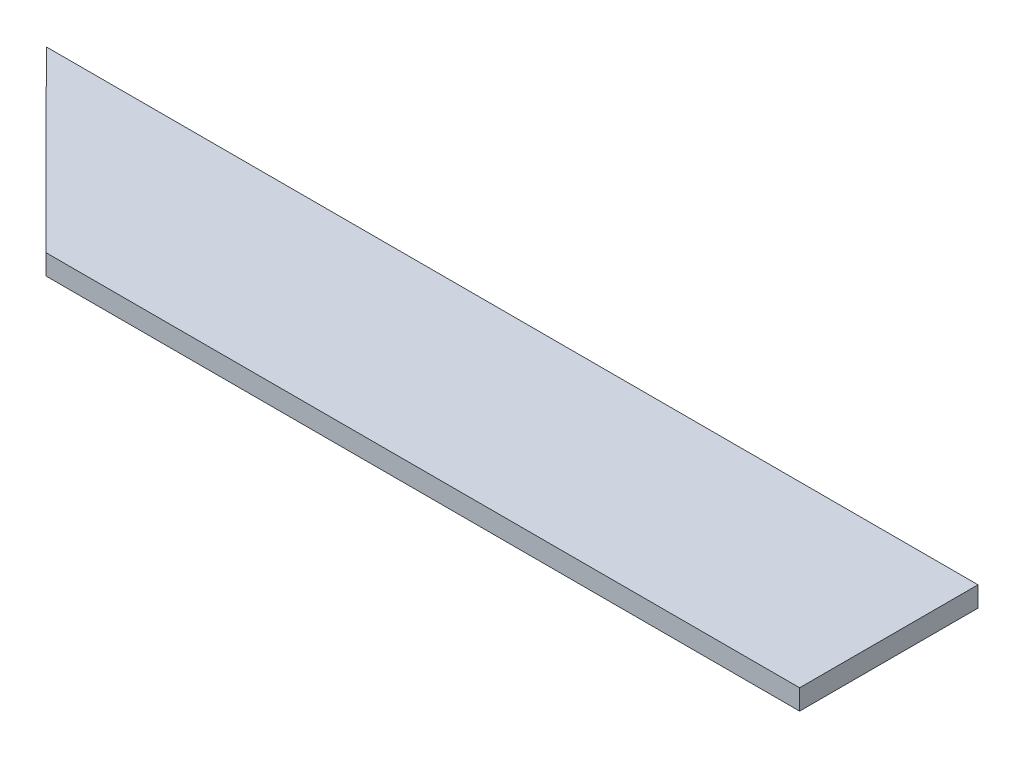
ISO-10303-21;
HEADER;
FILE_DESCRIPTION(('STEP AP214'),'2;1');
FILE_NAME('part.step','',(''),(''),'','','');
FILE_SCHEMA(('AUTOMOTIVE_DESIGN { 1 0 10303 214 1 1 1 1 }'));
ENDSEC;
DATA;
#1=APPLICATION_CONTEXT('core data for automotive mechanical design processes');
#2=APPLICATION_PROTOCOL_DEFINITION('international standard','automotive_design',2000,#1);
#3=PRODUCT_CONTEXT('',#1,'mechanical');
#4=PRODUCT('Part','Part','',(#3));
#5=PRODUCT_RELATED_PRODUCT_CATEGORY('part','',(#4));
#6=PRODUCT_DEFINITION_FORMATION('','',#4);
#7=PRODUCT_DEFINITION_CONTEXT('part definition',#1,'design');
#8=PRODUCT_DEFINITION('design','',#6,#7);
#9=PRODUCT_DEFINITION_SHAPE('','',#8);
#10=(LENGTH_UNIT() NAMED_UNIT(*) SI_UNIT(.MILLI.,.METRE.));
#11=(NAMED_UNIT(*) PLANE_ANGLE_UNIT() SI_UNIT($,.RADIAN.));
#12=(NAMED_UNIT(*) SI_UNIT($,.STERADIAN.) SOLID_ANGLE_UNIT());
#13=UNCERTAINTY_MEASURE_WITH_UNIT(LENGTH_MEASURE(1.E-05),#10,'distance_accuracy_value','');
#14=(GEOMETRIC_REPRESENTATION_CONTEXT(3) GLOBAL_UNCERTAINTY_ASSIGNED_CONTEXT((#13)) GLOBAL_UNIT_ASSIGNED_CONTEXT((#10,
#11,#12)) REPRESENTATION_CONTEXT('',''));
#15=CARTESIAN_POINT('',(0.,0.,0.));
#16=DIRECTION('',(0.,0.,1.));
#17=DIRECTION('',(1.,0.,0.));
#18=AXIS2_PLACEMENT_3D('',#15,#16,#17);
#19=CARTESIAN_POINT('',(-99.1551992517756,3.,-31.992171884113));
#20=DIRECTION('',(0.,0.,1.));
#21=DIRECTION('',(1.,0.,0.));
#22=AXIS2_PLACEMENT_3D('',#19,#20,#21);
#23=PLANE('',#22);
#24=DIRECTION('',(-1.,0.,0.));
#25=VECTOR('',#24,1.);
#26=CARTESIAN_POINT('',(-99.1551992517756,0.,-31.992171884113));
#27=LINE('',#26,#25);
#28=CARTESIAN_POINT('',(38.8448007482244,0.,-31.992171884113));
#29=VERTEX_POINT('',#28);
#30=CARTESIAN_POINT('',(-99.1551992517756,0.,-31.992171884113));
#31=VERTEX_POINT('',#30);
#32=EDGE_CURVE('E96',#29,#31,#27,.T.);
#33=ORIENTED_EDGE('',*,*,#32,.T.);
#34=DIRECTION('',(0.,-1.,0.));
#35=VECTOR('',#34,1.);
#36=CARTESIAN_POINT('',(-99.1551992517756,3.,-31.992171884113));
#37=LINE('',#36,#35);
#38=CARTESIAN_POINT('',(-99.1551992517756,3.,-31.992171884113));
#39=VERTEX_POINT('',#38);
#40=EDGE_CURVE('E11',#39,#31,#37,.T.);
#41=ORIENTED_EDGE('',*,*,#40,.F.);
#42=DIRECTION('',(-1.,0.,0.));
#43=VECTOR('',#42,1.);
#44=CARTESIAN_POINT('',(-99.1551992517756,3.,-31.992171884113));
#45=LINE('',#44,#43);
#46=CARTESIAN_POINT('',(38.8448007482244,3.,-31.992171884113));
#47=VERTEX_POINT('',#46);
#48=EDGE_CURVE('E84',#47,#39,#45,.T.);
#49=ORIENTED_EDGE('',*,*,#48,.F.);
#50=DIRECTION('',(0.,-1.,0.));
#51=VECTOR('',#50,1.);
#52=CARTESIAN_POINT('',(38.8448007482244,3.,-31.992171884113));
#53=LINE('',#52,#51);
#54=EDGE_CURVE('E92',#47,#29,#53,.T.);
#55=ORIENTED_EDGE('',*,*,#54,.T.);
#56=EDGE_LOOP('',(#33,#41,#49,#55));
#57=FACE_BOUND('',#56,.T.);
#58=ADVANCED_FACE('F33',(#57),#23,.F.);
#59=CARTESIAN_POINT('',(-99.1551992517756,3.,-31.992171884113));
#60=DIRECTION('',(0.707720878833949,0.,-0.70649214975292));
#61=DIRECTION('',(-0.70649214975292,0.,-0.707720878833949));
#62=AXIS2_PLACEMENT_3D('',#59,#60,#61);
#63=PLANE('',#62);
#64=DIRECTION('',(0.70649214975292,0.,0.707720878833949));
#65=VECTOR('',#64,1.);
#66=CARTESIAN_POINT('',(-99.1551992517756,0.,-31.992171884113));
#67=LINE('',#66,#65);
#68=CARTESIAN_POINT('',(-72.779752275561,0.,-5.5708528076405));
#69=VERTEX_POINT('',#68);
#70=EDGE_CURVE('E88',#31,#69,#67,.T.);
#71=ORIENTED_EDGE('',*,*,#70,.T.);
#72=DIRECTION('',(0.,-1.,0.));
#73=VECTOR('',#72,1.);
#74=CARTESIAN_POINT('',(-72.779752275561,3.,-5.5708528076405));
#75=LINE('',#74,#73);
#76=CARTESIAN_POINT('',(-72.779752275561,3.,-5.5708528076405));
#77=VERTEX_POINT('',#76);
#78=EDGE_CURVE('E41',#77,#69,#75,.T.);
#79=ORIENTED_EDGE('',*,*,#78,.F.);
#80=DIRECTION('',(0.70649214975292,0.,0.707720878833949));
#81=VECTOR('',#80,1.);
#82=CARTESIAN_POINT('',(-99.1551992517756,3.,-31.992171884113));
#83=LINE('',#82,#81);
#84=EDGE_CURVE('E79',#39,#77,#83,.T.);
#85=ORIENTED_EDGE('',*,*,#84,.F.);
#86=ORIENTED_EDGE('',*,*,#40,.T.);
#87=EDGE_LOOP('',(#71,#79,#85,#86));
#88=FACE_BOUND('',#87,.T.);
#89=ADVANCED_FACE('F87',(#88),#63,.F.);
#90=CARTESIAN_POINT('',(-72.779752275561,3.,-5.5708528076405));
#91=DIRECTION('',(0.,0.,-1.));
#92=DIRECTION('',(-1.,0.,0.));
#93=AXIS2_PLACEMENT_3D('',#90,#91,#92);
#94=PLANE('',#93);
#95=DIRECTION('',(1.,0.,0.));
#96=VECTOR('',#95,1.);
#97=CARTESIAN_POINT('',(-72.779752275561,0.,-5.5708528076405));
#98=LINE('',#97,#96);
#99=CARTESIAN_POINT('',(38.8448007482244,0.,-5.5708528076405));
#100=VERTEX_POINT('',#99);
#101=EDGE_CURVE('E66',#69,#100,#98,.T.);
#102=ORIENTED_EDGE('',*,*,#101,.T.);
#103=DIRECTION('',(0.,-1.,0.));
#104=VECTOR('',#103,1.);
#105=CARTESIAN_POINT('',(38.8448007482244,3.,-5.5708528076405));
#106=LINE('',#105,#104);
#107=CARTESIAN_POINT('',(38.8448007482244,3.,-5.5708528076405));
#108=VERTEX_POINT('',#107);
#109=EDGE_CURVE('E89',#108,#100,#106,.T.);
#110=ORIENTED_EDGE('',*,*,#109,.F.);
#111=DIRECTION('',(1.,0.,0.));
#112=VECTOR('',#111,1.);
#113=CARTESIAN_POINT('',(-72.779752275561,3.,-5.5708528076405));
#114=LINE('',#113,#112);
#115=EDGE_CURVE('E82',#77,#108,#114,.T.);
#116=ORIENTED_EDGE('',*,*,#115,.F.);
#117=ORIENTED_EDGE('',*,*,#78,.T.);
#118=EDGE_LOOP('',(#102,#110,#116,#117));
#119=FACE_BOUND('',#118,.T.);
#120=ADVANCED_FACE('F90',(#119),#94,.F.);
#121=CARTESIAN_POINT('',(38.8448007482244,3.,-31.992171884113));
#122=DIRECTION('',(-1.,0.,0.));
#123=DIRECTION('',(0.,0.,1.));
#124=AXIS2_PLACEMENT_3D('',#121,#122,#123);
#125=PLANE('',#124);
#126=DIRECTION('',(0.,0.,-1.));
#127=VECTOR('',#126,1.);
#128=CARTESIAN_POINT('',(38.8448007482244,0.,-31.992171884113));
#129=LINE('',#128,#127);
#130=EDGE_CURVE('E72',#100,#29,#129,.T.);
#131=ORIENTED_EDGE('',*,*,#130,.T.);
#132=ORIENTED_EDGE('',*,*,#54,.F.);
#133=DIRECTION('',(0.,0.,-1.));
#134=VECTOR('',#133,1.);
#135=CARTESIAN_POINT('',(38.8448007482244,3.,-31.992171884113));
#136=LINE('',#135,#134);
#137=EDGE_CURVE('E49',#108,#47,#136,.T.);
#138=ORIENTED_EDGE('',*,*,#137,.F.);
#139=ORIENTED_EDGE('',*,*,#109,.T.);
#140=EDGE_LOOP('',(#131,#132,#138,#139));
#141=FACE_BOUND('',#140,.T.);
#142=ADVANCED_FACE('F103',(#141),#125,.F.);
#143=CARTESIAN_POINT('',(0.,3.,0.));
#144=DIRECTION('',(0.,-1.,0.));
#145=DIRECTION('',(0.,0.,-1.));
#146=AXIS2_PLACEMENT_3D('',#143,#144,#145);
#147=PLANE('',#146);
#148=ORIENTED_EDGE('',*,*,#48,.T.);
#149=ORIENTED_EDGE('',*,*,#84,.T.);
#150=ORIENTED_EDGE('',*,*,#115,.T.);
#151=ORIENTED_EDGE('',*,*,#137,.T.);
#152=EDGE_LOOP('',(#148,#149,#150,#151));
#153=FACE_BOUND('',#152,.T.);
#154=ADVANCED_FACE('F80',(#153),#147,.F.);
#155=CARTESIAN_POINT('',(0.,0.,0.));
#156=DIRECTION('',(0.,-1.,0.));
#157=DIRECTION('',(0.,0.,-1.));
#158=AXIS2_PLACEMENT_3D('',#155,#156,#157);
#159=PLANE('',#158);
#160=ORIENTED_EDGE('',*,*,#32,.F.);
#161=ORIENTED_EDGE('',*,*,#130,.F.);
#162=ORIENTED_EDGE('',*,*,#101,.F.);
#163=ORIENTED_EDGE('',*,*,#70,.F.);
#164=EDGE_LOOP('',(#160,#161,#162,#163));
#165=FACE_BOUND('',#164,.T.);
#166=ADVANCED_FACE('F106',(#165),#159,.T.);
#167=CLOSED_SHELL('',(#58,#89,#120,#142,#154,#166));
#168=MANIFOLD_SOLID_BREP('B2',#167);
#169=ADVANCED_BREP_SHAPE_REPRESENTATION('',(#18,#168),#14);
#170=SHAPE_DEFINITION_REPRESENTATION(#9,#169);
ENDSEC;
END-ISO-10303-21;
